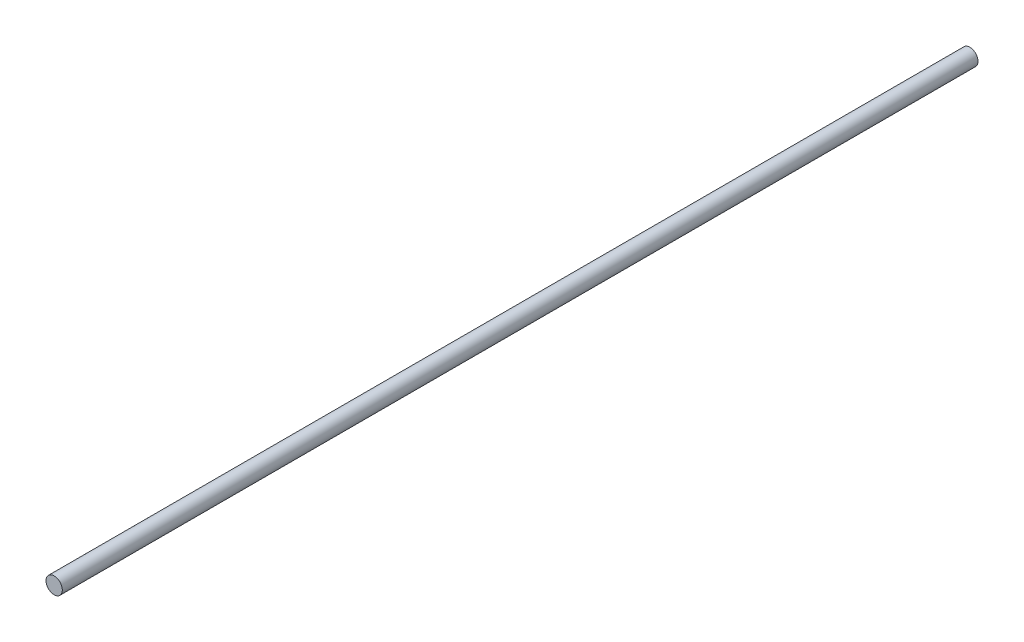
ISO-10303-21;
HEADER;
FILE_DESCRIPTION(('STEP AP214'),'2;1');
FILE_NAME('part.step','',(''),(''),'','','');
FILE_SCHEMA(('AUTOMOTIVE_DESIGN { 1 0 10303 214 1 1 1 1 }'));
ENDSEC;
DATA;
#1=APPLICATION_CONTEXT('core data for automotive mechanical design processes');
#2=APPLICATION_PROTOCOL_DEFINITION('international standard','automotive_design',2000,#1);
#3=PRODUCT_CONTEXT('',#1,'mechanical');
#4=PRODUCT('Part','Part','',(#3));
#5=PRODUCT_RELATED_PRODUCT_CATEGORY('part','',(#4));
#6=PRODUCT_DEFINITION_FORMATION('','',#4);
#7=PRODUCT_DEFINITION_CONTEXT('part definition',#1,'design');
#8=PRODUCT_DEFINITION('design','',#6,#7);
#9=PRODUCT_DEFINITION_SHAPE('','',#8);
#10=(LENGTH_UNIT() NAMED_UNIT(*) SI_UNIT(.MILLI.,.METRE.));
#11=(NAMED_UNIT(*) PLANE_ANGLE_UNIT() SI_UNIT($,.RADIAN.));
#12=(NAMED_UNIT(*) SI_UNIT($,.STERADIAN.) SOLID_ANGLE_UNIT());
#13=UNCERTAINTY_MEASURE_WITH_UNIT(LENGTH_MEASURE(1.E-05),#10,'distance_accuracy_value','');
#14=(GEOMETRIC_REPRESENTATION_CONTEXT(3) GLOBAL_UNCERTAINTY_ASSIGNED_CONTEXT((#13)) GLOBAL_UNIT_ASSIGNED_CONTEXT((#10,
#11,#12)) REPRESENTATION_CONTEXT('',''));
#15=CARTESIAN_POINT('',(0.,0.,0.));
#16=DIRECTION('',(0.,0.,1.));
#17=DIRECTION('',(1.,0.,0.));
#18=AXIS2_PLACEMENT_3D('',#15,#16,#17);
#19=CARTESIAN_POINT('',(0.,0.,356.));
#20=DIRECTION('',(0.,0.,-1.));
#21=DIRECTION('',(-1.,0.,0.));
#22=AXIS2_PLACEMENT_3D('',#19,#20,#21);
#23=CYLINDRICAL_SURFACE('',#22,3.175);
#24=CARTESIAN_POINT('',(0.,0.,356.));
#25=DIRECTION('',(0.,0.,1.));
#26=DIRECTION('',(1.,0.,0.));
#27=AXIS2_PLACEMENT_3D('',#24,#25,#26);
#28=CIRCLE('',#27,3.175);
#29=CARTESIAN_POINT('',(3.175,0.,356.));
#30=VERTEX_POINT('',#29);
#31=EDGE_CURVE('E10',#30,#30,#28,.T.);
#32=ORIENTED_EDGE('',*,*,#31,.F.);
#33=EDGE_LOOP('',(#32));
#34=FACE_BOUND('',#33,.T.);
#35=CARTESIAN_POINT('',(0.,0.,0.));
#36=DIRECTION('',(0.,0.,1.));
#37=DIRECTION('',(1.,0.,0.));
#38=AXIS2_PLACEMENT_3D('',#35,#36,#37);
#39=CIRCLE('',#38,3.175);
#40=CARTESIAN_POINT('',(3.175,0.,0.));
#41=VERTEX_POINT('',#40);
#42=EDGE_CURVE('E34',#41,#41,#39,.T.);
#43=ORIENTED_EDGE('',*,*,#42,.T.);
#44=EDGE_LOOP('',(#43));
#45=FACE_BOUND('',#44,.T.);
#46=ADVANCED_FACE('F31',(#34,#45),#23,.T.);
#47=CARTESIAN_POINT('',(0.,0.,356.));
#48=DIRECTION('',(0.,0.,1.));
#49=DIRECTION('',(1.,0.,0.));
#50=AXIS2_PLACEMENT_3D('',#47,#48,#49);
#51=PLANE('',#50);
#52=ORIENTED_EDGE('',*,*,#31,.T.);
#53=EDGE_LOOP('',(#52));
#54=FACE_BOUND('',#53,.T.);
#55=ADVANCED_FACE('F46',(#54),#51,.T.);
#56=CARTESIAN_POINT('',(0.,0.,0.));
#57=DIRECTION('',(0.,0.,1.));
#58=DIRECTION('',(1.,0.,0.));
#59=AXIS2_PLACEMENT_3D('',#56,#57,#58);
#60=PLANE('',#59);
#61=ORIENTED_EDGE('',*,*,#42,.F.);
#62=EDGE_LOOP('',(#61));
#63=FACE_BOUND('',#62,.T.);
#64=ADVANCED_FACE('F44',(#63),#60,.F.);
#65=CLOSED_SHELL('',(#46,#55,#64));
#66=MANIFOLD_SOLID_BREP('B2',#65);
#67=ADVANCED_BREP_SHAPE_REPRESENTATION('',(#18,#66),#14);
#68=SHAPE_DEFINITION_REPRESENTATION(#9,#67);
ENDSEC;
END-ISO-10303-21;
